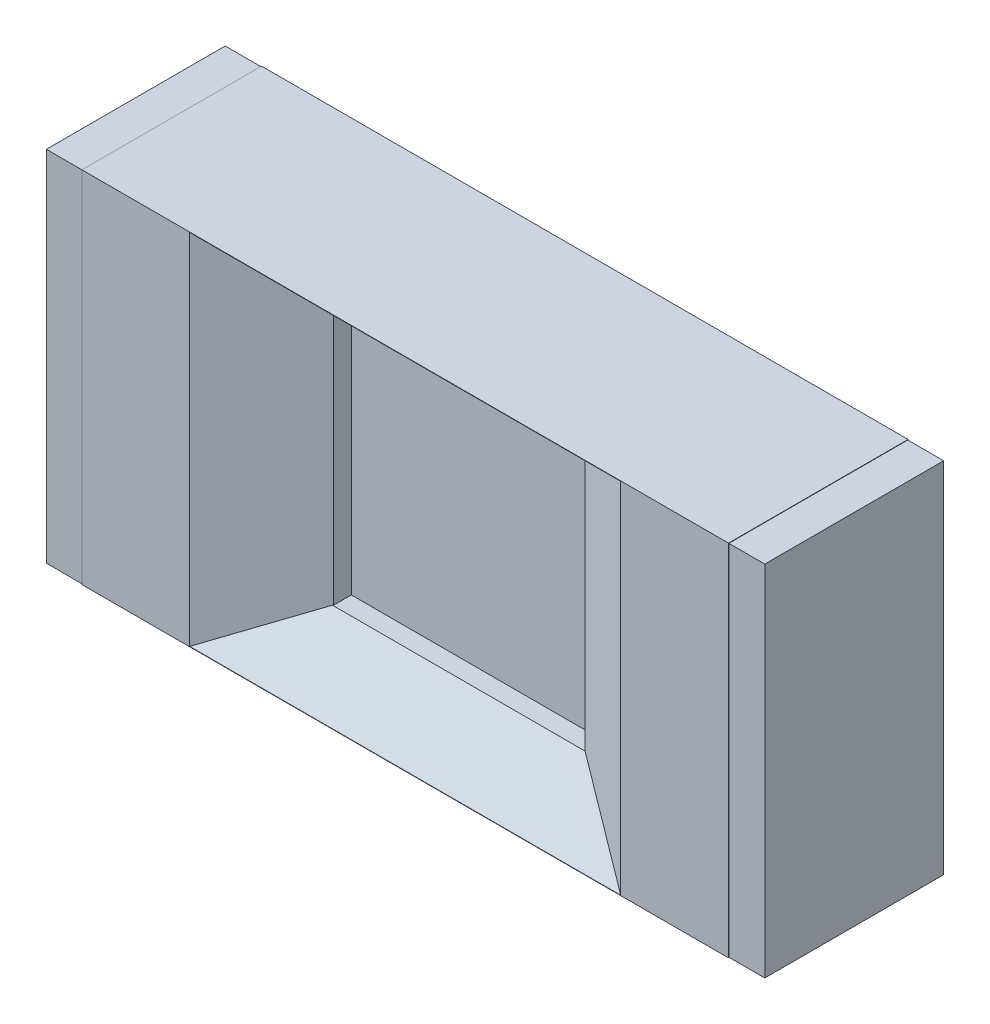
ISO-10303-21;
HEADER;
FILE_DESCRIPTION(('STEP AP214'),'2;1');
FILE_NAME('part.step','',(''),(''),'','','');
FILE_SCHEMA(('AUTOMOTIVE_DESIGN { 1 0 10303 214 1 1 1 1 }'));
ENDSEC;
DATA;
#1=APPLICATION_CONTEXT('core data for automotive mechanical design processes');
#2=APPLICATION_PROTOCOL_DEFINITION('international standard','automotive_design',2000,#1);
#3=PRODUCT_CONTEXT('',#1,'mechanical');
#4=PRODUCT('Part','Part','',(#3));
#5=PRODUCT_RELATED_PRODUCT_CATEGORY('part','',(#4));
#6=PRODUCT_DEFINITION_FORMATION('','',#4);
#7=PRODUCT_DEFINITION_CONTEXT('part definition',#1,'design');
#8=PRODUCT_DEFINITION('design','',#6,#7);
#9=PRODUCT_DEFINITION_SHAPE('','',#8);
#10=(LENGTH_UNIT() NAMED_UNIT(*) SI_UNIT(.MILLI.,.METRE.));
#11=(NAMED_UNIT(*) PLANE_ANGLE_UNIT() SI_UNIT($,.RADIAN.));
#12=(NAMED_UNIT(*) SI_UNIT($,.STERADIAN.) SOLID_ANGLE_UNIT());
#13=UNCERTAINTY_MEASURE_WITH_UNIT(LENGTH_MEASURE(1.E-05),#10,'distance_accuracy_value','');
#14=(GEOMETRIC_REPRESENTATION_CONTEXT(3) GLOBAL_UNCERTAINTY_ASSIGNED_CONTEXT((#13)) GLOBAL_UNIT_ASSIGNED_CONTEXT((#10,
#11,#12)) REPRESENTATION_CONTEXT('',''));
#15=CARTESIAN_POINT('',(0.,0.,0.));
#16=DIRECTION('',(0.,0.,1.));
#17=DIRECTION('',(1.,0.,0.));
#18=AXIS2_PLACEMENT_3D('',#15,#16,#17);
#19=CARTESIAN_POINT('',(28.13,-12.,3.201));
#20=DIRECTION('',(0.,0.,-1.));
#21=DIRECTION('',(0.,-1.,0.));
#22=AXIS2_PLACEMENT_3D('',#19,#20,#21);
#23=PLANE('',#22);
#24=DIRECTION('',(1.,0.,0.));
#25=VECTOR('',#24,1.);
#26=CARTESIAN_POINT('',(28.13,-11.999,3.201));
#27=LINE('',#26,#25);
#28=CARTESIAN_POINT('',(28.03,-11.999,3.201));
#29=VERTEX_POINT('',#28);
#30=CARTESIAN_POINT('',(28.13,-11.999,3.201));
#31=VERTEX_POINT('',#30);
#32=EDGE_CURVE('E207',#29,#31,#27,.T.);
#33=ORIENTED_EDGE('',*,*,#32,.F.);
#34=DIRECTION('',(0.,-1.,0.));
#35=VECTOR('',#34,1.);
#36=CARTESIAN_POINT('',(28.03,-12.,3.201));
#37=LINE('',#36,#35);
#38=CARTESIAN_POINT('',(28.03,-11.001,3.201));
#39=VERTEX_POINT('',#38);
#40=EDGE_CURVE('E11',#39,#29,#37,.T.);
#41=ORIENTED_EDGE('',*,*,#40,.F.);
#42=DIRECTION('',(1.,0.,0.));
#43=VECTOR('',#42,1.);
#44=CARTESIAN_POINT('',(28.13,-11.001,3.201));
#45=LINE('',#44,#43);
#46=CARTESIAN_POINT('',(28.13,-11.001,3.201));
#47=VERTEX_POINT('',#46);
#48=EDGE_CURVE('E205',#39,#47,#45,.T.);
#49=ORIENTED_EDGE('',*,*,#48,.T.);
#50=DIRECTION('',(0.,-1.,0.));
#51=VECTOR('',#50,1.);
#52=CARTESIAN_POINT('',(28.13,-12.,3.201));
#53=LINE('',#52,#51);
#54=EDGE_CURVE('E170',#47,#31,#53,.T.);
#55=ORIENTED_EDGE('',*,*,#54,.T.);
#56=EDGE_LOOP('',(#33,#41,#49,#55));
#57=FACE_BOUND('',#56,.T.);
#58=ADVANCED_FACE('F18',(#57),#23,.T.);
#59=CARTESIAN_POINT('',(28.03,-12.,3.2));
#60=DIRECTION('',(-1.,0.,0.));
#61=DIRECTION('',(0.,0.,1.));
#62=AXIS2_PLACEMENT_3D('',#59,#60,#61);
#63=PLANE('',#62);
#64=ORIENTED_EDGE('',*,*,#40,.T.);
#65=DIRECTION('',(0.,0.,1.));
#66=VECTOR('',#65,1.);
#67=CARTESIAN_POINT('',(28.03,-11.999,3.2));
#68=LINE('',#67,#66);
#69=CARTESIAN_POINT('',(28.03,-11.999,3.699));
#70=VERTEX_POINT('',#69);
#71=EDGE_CURVE('E264',#29,#70,#68,.T.);
#72=ORIENTED_EDGE('',*,*,#71,.T.);
#73=DIRECTION('',(0.,1.,0.));
#74=VECTOR('',#73,1.);
#75=CARTESIAN_POINT('',(28.03,-12.,3.699));
#76=LINE('',#75,#74);
#77=CARTESIAN_POINT('',(28.03,-11.001,3.699));
#78=VERTEX_POINT('',#77);
#79=EDGE_CURVE('E265',#70,#78,#76,.T.);
#80=ORIENTED_EDGE('',*,*,#79,.T.);
#81=DIRECTION('',(0.,0.,-1.));
#82=VECTOR('',#81,1.);
#83=CARTESIAN_POINT('',(28.03,-11.001,3.2));
#84=LINE('',#83,#82);
#85=EDGE_CURVE('E29',#78,#39,#84,.T.);
#86=ORIENTED_EDGE('',*,*,#85,.T.);
#87=EDGE_LOOP('',(#64,#72,#80,#86));
#88=FACE_BOUND('',#87,.T.);
#89=ADVANCED_FACE('F490',(#88),#63,.T.);
#90=CARTESIAN_POINT('',(28.13,-11.001,3.2));
#91=DIRECTION('',(0.,1.,0.));
#92=DIRECTION('',(1.,0.,0.));
#93=AXIS2_PLACEMENT_3D('',#90,#91,#92);
#94=PLANE('',#93);
#95=ORIENTED_EDGE('',*,*,#48,.F.);
#96=ORIENTED_EDGE('',*,*,#85,.F.);
#97=DIRECTION('',(1.,0.,0.));
#98=VECTOR('',#97,1.);
#99=CARTESIAN_POINT('',(28.13,-11.001,3.699));
#100=LINE('',#99,#98);
#101=CARTESIAN_POINT('',(28.13,-11.001,3.699));
#102=VERTEX_POINT('',#101);
#103=EDGE_CURVE('E249',#78,#102,#100,.T.);
#104=ORIENTED_EDGE('',*,*,#103,.T.);
#105=DIRECTION('',(0.,0.,-1.));
#106=VECTOR('',#105,1.);
#107=CARTESIAN_POINT('',(28.13,-11.001,3.2));
#108=LINE('',#107,#106);
#109=EDGE_CURVE('E174',#102,#47,#108,.T.);
#110=ORIENTED_EDGE('',*,*,#109,.T.);
#111=EDGE_LOOP('',(#95,#96,#104,#110));
#112=FACE_BOUND('',#111,.T.);
#113=ADVANCED_FACE('F20',(#112),#94,.T.);
#114=CARTESIAN_POINT('',(28.13,-11.999,3.2));
#115=DIRECTION('',(0.,-1.,0.));
#116=DIRECTION('',(-1.,0.,0.));
#117=AXIS2_PLACEMENT_3D('',#114,#115,#116);
#118=PLANE('',#117);
#119=DIRECTION('',(1.,0.,0.));
#120=VECTOR('',#119,1.);
#121=CARTESIAN_POINT('',(28.13,-11.999,3.699));
#122=LINE('',#121,#120);
#123=CARTESIAN_POINT('',(28.13,-11.999,3.699));
#124=VERTEX_POINT('',#123);
#125=EDGE_CURVE('E261',#70,#124,#122,.T.);
#126=ORIENTED_EDGE('',*,*,#125,.F.);
#127=ORIENTED_EDGE('',*,*,#71,.F.);
#128=ORIENTED_EDGE('',*,*,#32,.T.);
#129=DIRECTION('',(0.,0.,1.));
#130=VECTOR('',#129,1.);
#131=CARTESIAN_POINT('',(28.13,-11.999,3.2));
#132=LINE('',#131,#130);
#133=EDGE_CURVE('E175',#31,#124,#132,.T.);
#134=ORIENTED_EDGE('',*,*,#133,.T.);
#135=EDGE_LOOP('',(#126,#127,#128,#134));
#136=FACE_BOUND('',#135,.T.);
#137=ADVANCED_FACE('F503',(#136),#118,.T.);
#138=CARTESIAN_POINT('',(28.13,-12.,3.699));
#139=DIRECTION('',(0.,0.,1.));
#140=DIRECTION('',(1.,0.,0.));
#141=AXIS2_PLACEMENT_3D('',#138,#139,#140);
#142=PLANE('',#141);
#143=ORIENTED_EDGE('',*,*,#103,.F.);
#144=ORIENTED_EDGE('',*,*,#79,.F.);
#145=ORIENTED_EDGE('',*,*,#125,.T.);
#146=DIRECTION('',(0.,1.,0.));
#147=VECTOR('',#146,1.);
#148=CARTESIAN_POINT('',(28.13,-12.,3.699));
#149=LINE('',#148,#147);
#150=EDGE_CURVE('E232',#124,#102,#149,.T.);
#151=ORIENTED_EDGE('',*,*,#150,.T.);
#152=EDGE_LOOP('',(#143,#144,#145,#151));
#153=FACE_BOUND('',#152,.T.);
#154=ADVANCED_FACE('F506',(#153),#142,.T.);
#155=CARTESIAN_POINT('',(28.13,-11.5,3.45));
#156=DIRECTION('',(-1.,0.,0.));
#157=DIRECTION('',(0.,0.,1.));
#158=AXIS2_PLACEMENT_3D('',#155,#156,#157);
#159=PLANE('',#158);
#160=ORIENTED_EDGE('',*,*,#150,.F.);
#161=ORIENTED_EDGE('',*,*,#133,.F.);
#162=ORIENTED_EDGE('',*,*,#54,.F.);
#163=ORIENTED_EDGE('',*,*,#109,.F.);
#164=EDGE_LOOP('',(#160,#161,#162,#163));
#165=FACE_BOUND('',#164,.T.);
#166=DIRECTION('',(0.,1.,0.));
#167=VECTOR('',#166,1.);
#168=CARTESIAN_POINT('',(28.13,-12.,3.7));
#169=LINE('',#168,#167);
#170=CARTESIAN_POINT('',(28.13,-12.,3.7));
#171=VERTEX_POINT('',#170);
#172=CARTESIAN_POINT('',(28.13,-11.,3.7));
#173=VERTEX_POINT('',#172);
#174=EDGE_CURVE('E254',#171,#173,#169,.T.);
#175=ORIENTED_EDGE('',*,*,#174,.T.);
#176=DIRECTION('',(0.,0.,-1.));
#177=VECTOR('',#176,1.);
#178=CARTESIAN_POINT('',(28.13,-11.,3.2));
#179=LINE('',#178,#177);
#180=CARTESIAN_POINT('',(28.13,-11.,3.2));
#181=VERTEX_POINT('',#180);
#182=EDGE_CURVE('E227',#173,#181,#179,.T.);
#183=ORIENTED_EDGE('',*,*,#182,.T.);
#184=DIRECTION('',(0.,-1.,0.));
#185=VECTOR('',#184,1.);
#186=CARTESIAN_POINT('',(28.13,-12.,3.2));
#187=LINE('',#186,#185);
#188=CARTESIAN_POINT('',(28.13,-12.,3.2));
#189=VERTEX_POINT('',#188);
#190=EDGE_CURVE('E218',#181,#189,#187,.T.);
#191=ORIENTED_EDGE('',*,*,#190,.T.);
#192=DIRECTION('',(0.,0.,1.));
#193=VECTOR('',#192,1.);
#194=CARTESIAN_POINT('',(28.13,-12.,3.2));
#195=LINE('',#194,#193);
#196=EDGE_CURVE('E228',#189,#171,#195,.T.);
#197=ORIENTED_EDGE('',*,*,#196,.T.);
#198=EDGE_LOOP('',(#175,#183,#191,#197));
#199=FACE_BOUND('',#198,.T.);
#200=ADVANCED_FACE('F388',(#165,#199),#159,.T.);
#201=CARTESIAN_POINT('',(29.93,-12.,3.201));
#202=DIRECTION('',(0.,0.,-1.));
#203=DIRECTION('',(-1.,0.,0.));
#204=AXIS2_PLACEMENT_3D('',#201,#202,#203);
#205=PLANE('',#204);
#206=DIRECTION('',(0.,-1.,0.));
#207=VECTOR('',#206,1.);
#208=CARTESIAN_POINT('',(29.93,-12.,3.201));
#209=LINE('',#208,#207);
#210=CARTESIAN_POINT('',(29.93,-11.001,3.201));
#211=VERTEX_POINT('',#210);
#212=CARTESIAN_POINT('',(29.93,-11.999,3.201));
#213=VERTEX_POINT('',#212);
#214=EDGE_CURVE('E191',#211,#213,#209,.T.);
#215=ORIENTED_EDGE('',*,*,#214,.F.);
#216=DIRECTION('',(-1.,0.,0.));
#217=VECTOR('',#216,1.);
#218=CARTESIAN_POINT('',(29.93,-11.001,3.201));
#219=LINE('',#218,#217);
#220=CARTESIAN_POINT('',(30.03,-11.001,3.201));
#221=VERTEX_POINT('',#220);
#222=EDGE_CURVE('E213',#221,#211,#219,.T.);
#223=ORIENTED_EDGE('',*,*,#222,.F.);
#224=DIRECTION('',(0.,-1.,0.));
#225=VECTOR('',#224,1.);
#226=CARTESIAN_POINT('',(30.03,-12.,3.201));
#227=LINE('',#226,#225);
#228=CARTESIAN_POINT('',(30.03,-11.999,3.201));
#229=VERTEX_POINT('',#228);
#230=EDGE_CURVE('E277',#221,#229,#227,.T.);
#231=ORIENTED_EDGE('',*,*,#230,.T.);
#232=DIRECTION('',(-1.,0.,0.));
#233=VECTOR('',#232,1.);
#234=CARTESIAN_POINT('',(29.93,-11.999,3.201));
#235=LINE('',#234,#233);
#236=EDGE_CURVE('E267',#229,#213,#235,.T.);
#237=ORIENTED_EDGE('',*,*,#236,.T.);
#238=EDGE_LOOP('',(#215,#223,#231,#237));
#239=FACE_BOUND('',#238,.T.);
#240=ADVANCED_FACE('F515',(#239),#205,.T.);
#241=CARTESIAN_POINT('',(30.03,-11.,3.2));
#242=DIRECTION('',(1.,0.,0.));
#243=DIRECTION('',(0.,1.,0.));
#244=AXIS2_PLACEMENT_3D('',#241,#242,#243);
#245=PLANE('',#244);
#246=ORIENTED_EDGE('',*,*,#230,.F.);
#247=DIRECTION('',(0.,0.,-1.));
#248=VECTOR('',#247,1.);
#249=CARTESIAN_POINT('',(30.03,-11.001,3.2));
#250=LINE('',#249,#248);
#251=CARTESIAN_POINT('',(30.03,-11.001,3.699));
#252=VERTEX_POINT('',#251);
#253=EDGE_CURVE('E209',#252,#221,#250,.T.);
#254=ORIENTED_EDGE('',*,*,#253,.F.);
#255=DIRECTION('',(0.,1.,0.));
#256=VECTOR('',#255,1.);
#257=CARTESIAN_POINT('',(30.03,-12.,3.699));
#258=LINE('',#257,#256);
#259=CARTESIAN_POINT('',(30.03,-11.999,3.699));
#260=VERTEX_POINT('',#259);
#261=EDGE_CURVE('E182',#260,#252,#258,.T.);
#262=ORIENTED_EDGE('',*,*,#261,.F.);
#263=DIRECTION('',(0.,0.,1.));
#264=VECTOR('',#263,1.);
#265=CARTESIAN_POINT('',(30.03,-11.999,3.2));
#266=LINE('',#265,#264);
#267=EDGE_CURVE('E214',#229,#260,#266,.T.);
#268=ORIENTED_EDGE('',*,*,#267,.F.);
#269=EDGE_LOOP('',(#246,#254,#262,#268));
#270=FACE_BOUND('',#269,.T.);
#271=ADVANCED_FACE('F697',(#270),#245,.T.);
#272=CARTESIAN_POINT('',(29.93,-11.001,3.2));
#273=DIRECTION('',(0.,1.,0.));
#274=DIRECTION('',(1.,0.,0.));
#275=AXIS2_PLACEMENT_3D('',#272,#273,#274);
#276=PLANE('',#275);
#277=DIRECTION('',(0.,0.,-1.));
#278=VECTOR('',#277,1.);
#279=CARTESIAN_POINT('',(29.93,-11.001,3.2));
#280=LINE('',#279,#278);
#281=CARTESIAN_POINT('',(29.93,-11.001,3.699));
#282=VERTEX_POINT('',#281);
#283=EDGE_CURVE('E187',#282,#211,#280,.T.);
#284=ORIENTED_EDGE('',*,*,#283,.F.);
#285=DIRECTION('',(-1.,0.,0.));
#286=VECTOR('',#285,1.);
#287=CARTESIAN_POINT('',(29.93,-11.001,3.699));
#288=LINE('',#287,#286);
#289=EDGE_CURVE('E22',#252,#282,#288,.T.);
#290=ORIENTED_EDGE('',*,*,#289,.F.);
#291=ORIENTED_EDGE('',*,*,#253,.T.);
#292=ORIENTED_EDGE('',*,*,#222,.T.);
#293=EDGE_LOOP('',(#284,#290,#291,#292));
#294=FACE_BOUND('',#293,.T.);
#295=ADVANCED_FACE('F686',(#294),#276,.T.);
#296=CARTESIAN_POINT('',(29.93,-11.999,3.2));
#297=DIRECTION('',(0.,-1.,0.));
#298=DIRECTION('',(0.,0.,-1.));
#299=AXIS2_PLACEMENT_3D('',#296,#297,#298);
#300=PLANE('',#299);
#301=DIRECTION('',(0.,0.,1.));
#302=VECTOR('',#301,1.);
#303=CARTESIAN_POINT('',(29.93,-11.999,3.2));
#304=LINE('',#303,#302);
#305=CARTESIAN_POINT('',(29.93,-11.999,3.699));
#306=VERTEX_POINT('',#305);
#307=EDGE_CURVE('E168',#213,#306,#304,.T.);
#308=ORIENTED_EDGE('',*,*,#307,.F.);
#309=ORIENTED_EDGE('',*,*,#236,.F.);
#310=ORIENTED_EDGE('',*,*,#267,.T.);
#311=DIRECTION('',(-1.,0.,0.));
#312=VECTOR('',#311,1.);
#313=CARTESIAN_POINT('',(29.93,-11.999,3.699));
#314=LINE('',#313,#312);
#315=EDGE_CURVE('E186',#260,#306,#314,.T.);
#316=ORIENTED_EDGE('',*,*,#315,.T.);
#317=EDGE_LOOP('',(#308,#309,#310,#316));
#318=FACE_BOUND('',#317,.T.);
#319=ADVANCED_FACE('F677',(#318),#300,.T.);
#320=CARTESIAN_POINT('',(29.93,-12.,3.699));
#321=DIRECTION('',(0.,0.,1.));
#322=DIRECTION('',(1.,0.,0.));
#323=AXIS2_PLACEMENT_3D('',#320,#321,#322);
#324=PLANE('',#323);
#325=DIRECTION('',(0.,1.,0.));
#326=VECTOR('',#325,1.);
#327=CARTESIAN_POINT('',(29.93,-12.,3.699));
#328=LINE('',#327,#326);
#329=EDGE_CURVE('E192',#306,#282,#328,.T.);
#330=ORIENTED_EDGE('',*,*,#329,.F.);
#331=ORIENTED_EDGE('',*,*,#315,.F.);
#332=ORIENTED_EDGE('',*,*,#261,.T.);
#333=ORIENTED_EDGE('',*,*,#289,.T.);
#334=EDGE_LOOP('',(#330,#331,#332,#333));
#335=FACE_BOUND('',#334,.T.);
#336=ADVANCED_FACE('F498',(#335),#324,.T.);
#337=CARTESIAN_POINT('',(29.93,-11.5,3.45));
#338=DIRECTION('',(1.,0.,0.));
#339=DIRECTION('',(0.,1.,0.));
#340=AXIS2_PLACEMENT_3D('',#337,#338,#339);
#341=PLANE('',#340);
#342=ORIENTED_EDGE('',*,*,#329,.T.);
#343=ORIENTED_EDGE('',*,*,#283,.T.);
#344=ORIENTED_EDGE('',*,*,#214,.T.);
#345=ORIENTED_EDGE('',*,*,#307,.T.);
#346=EDGE_LOOP('',(#342,#343,#344,#345));
#347=FACE_BOUND('',#346,.T.);
#348=DIRECTION('',(0.,1.,0.));
#349=VECTOR('',#348,1.);
#350=CARTESIAN_POINT('',(29.93,-12.,3.7));
#351=LINE('',#350,#349);
#352=CARTESIAN_POINT('',(29.93,-12.,3.7));
#353=VERTEX_POINT('',#352);
#354=CARTESIAN_POINT('',(29.93,-11.,3.7));
#355=VERTEX_POINT('',#354);
#356=EDGE_CURVE('E255',#353,#355,#351,.T.);
#357=ORIENTED_EDGE('',*,*,#356,.F.);
#358=DIRECTION('',(0.,0.,1.));
#359=VECTOR('',#358,1.);
#360=CARTESIAN_POINT('',(29.93,-12.,3.2));
#361=LINE('',#360,#359);
#362=CARTESIAN_POINT('',(29.93,-12.,3.2));
#363=VERTEX_POINT('',#362);
#364=EDGE_CURVE('E344',#363,#353,#361,.T.);
#365=ORIENTED_EDGE('',*,*,#364,.F.);
#366=DIRECTION('',(0.,-1.,0.));
#367=VECTOR('',#366,1.);
#368=CARTESIAN_POINT('',(29.93,-12.,3.2));
#369=LINE('',#368,#367);
#370=CARTESIAN_POINT('',(29.93,-11.,3.2));
#371=VERTEX_POINT('',#370);
#372=EDGE_CURVE('E138',#371,#363,#369,.T.);
#373=ORIENTED_EDGE('',*,*,#372,.F.);
#374=DIRECTION('',(0.,0.,-1.));
#375=VECTOR('',#374,1.);
#376=CARTESIAN_POINT('',(29.93,-11.,3.2));
#377=LINE('',#376,#375);
#378=EDGE_CURVE('E242',#355,#371,#377,.T.);
#379=ORIENTED_EDGE('',*,*,#378,.F.);
#380=EDGE_LOOP('',(#357,#365,#373,#379));
#381=FACE_BOUND('',#380,.T.);
#382=ADVANCED_FACE('F453',(#347,#381),#341,.T.);
#383=CARTESIAN_POINT('',(29.03,-11.5,3.5));
#384=DIRECTION('',(0.,0.,-1.));
#385=DIRECTION('',(0.,-1.,0.));
#386=AXIS2_PLACEMENT_3D('',#383,#384,#385);
#387=PLANE('',#386);
#388=DIRECTION('',(0.,1.,0.));
#389=VECTOR('',#388,1.);
#390=CARTESIAN_POINT('',(28.68,-11.85,3.5));
#391=LINE('',#390,#389);
#392=CARTESIAN_POINT('',(28.68,-11.85,3.5));
#393=VERTEX_POINT('',#392);
#394=CARTESIAN_POINT('',(28.68,-11.15,3.5));
#395=VERTEX_POINT('',#394);
#396=EDGE_CURVE('E132',#393,#395,#391,.T.);
#397=ORIENTED_EDGE('',*,*,#396,.F.);
#398=DIRECTION('',(-1.,0.,0.));
#399=VECTOR('',#398,1.);
#400=CARTESIAN_POINT('',(29.38,-11.85,3.5));
#401=LINE('',#400,#399);
#402=CARTESIAN_POINT('',(29.38,-11.85,3.5));
#403=VERTEX_POINT('',#402);
#404=EDGE_CURVE('E197',#403,#393,#401,.T.);
#405=ORIENTED_EDGE('',*,*,#404,.F.);
#406=DIRECTION('',(0.,-1.,0.));
#407=VECTOR('',#406,1.);
#408=CARTESIAN_POINT('',(29.38,-11.15,3.5));
#409=LINE('',#408,#407);
#410=CARTESIAN_POINT('',(29.38,-11.15,3.5));
#411=VERTEX_POINT('',#410);
#412=EDGE_CURVE('E302',#411,#403,#409,.T.);
#413=ORIENTED_EDGE('',*,*,#412,.F.);
#414=DIRECTION('',(1.,0.,0.));
#415=VECTOR('',#414,1.);
#416=CARTESIAN_POINT('',(28.68,-11.15,3.5));
#417=LINE('',#416,#415);
#418=EDGE_CURVE('E137',#395,#411,#417,.T.);
#419=ORIENTED_EDGE('',*,*,#418,.F.);
#420=EDGE_LOOP('',(#397,#405,#413,#419));
#421=FACE_BOUND('',#420,.T.);
#422=ADVANCED_FACE('F520',(#421),#387,.F.);
#423=CARTESIAN_POINT('',(29.38,-11.15,3.7));
#424=DIRECTION('',(-1.,0.,0.));
#425=DIRECTION('',(0.,0.,1.));
#426=AXIS2_PLACEMENT_3D('',#423,#424,#425);
#427=PLANE('',#426);
#428=DIRECTION('',(0.,0.,-1.));
#429=VECTOR('',#428,1.);
#430=CARTESIAN_POINT('',(29.38,-11.15,3.7));
#431=LINE('',#430,#429);
#432=CARTESIAN_POINT('',(29.38,-11.15,3.55));
#433=VERTEX_POINT('',#432);
#434=EDGE_CURVE('E198',#433,#411,#431,.T.);
#435=ORIENTED_EDGE('',*,*,#434,.T.);
#436=ORIENTED_EDGE('',*,*,#412,.T.);
#437=DIRECTION('',(0.,0.,-1.));
#438=VECTOR('',#437,1.);
#439=CARTESIAN_POINT('',(29.38,-11.85,3.7));
#440=LINE('',#439,#438);
#441=CARTESIAN_POINT('',(29.38,-11.85,3.55));
#442=VERTEX_POINT('',#441);
#443=EDGE_CURVE('E193',#442,#403,#440,.T.);
#444=ORIENTED_EDGE('',*,*,#443,.F.);
#445=DIRECTION('',(0.,-1.,0.));
#446=VECTOR('',#445,1.);
#447=CARTESIAN_POINT('',(29.38,-11.15,3.55));
#448=LINE('',#447,#446);
#449=EDGE_CURVE('E204',#433,#442,#448,.T.);
#450=ORIENTED_EDGE('',*,*,#449,.F.);
#451=EDGE_LOOP('',(#435,#436,#444,#450));
#452=FACE_BOUND('',#451,.T.);
#453=ADVANCED_FACE('F502',(#452),#427,.T.);
#454=CARTESIAN_POINT('',(28.68,-11.85,3.7));
#455=DIRECTION('',(1.,0.,0.));
#456=DIRECTION('',(0.,1.,0.));
#457=AXIS2_PLACEMENT_3D('',#454,#455,#456);
#458=PLANE('',#457);
#459=DIRECTION('',(0.,0.,-1.));
#460=VECTOR('',#459,1.);
#461=CARTESIAN_POINT('',(28.68,-11.85,3.7));
#462=LINE('',#461,#460);
#463=CARTESIAN_POINT('',(28.68,-11.85,3.55));
#464=VERTEX_POINT('',#463);
#465=EDGE_CURVE('E258',#464,#393,#462,.T.);
#466=ORIENTED_EDGE('',*,*,#465,.T.);
#467=ORIENTED_EDGE('',*,*,#396,.T.);
#468=DIRECTION('',(0.,0.,-1.));
#469=VECTOR('',#468,1.);
#470=CARTESIAN_POINT('',(28.68,-11.15,3.7));
#471=LINE('',#470,#469);
#472=CARTESIAN_POINT('',(28.68,-11.15,3.55));
#473=VERTEX_POINT('',#472);
#474=EDGE_CURVE('E125',#473,#395,#471,.T.);
#475=ORIENTED_EDGE('',*,*,#474,.F.);
#476=DIRECTION('',(0.,1.,0.));
#477=VECTOR('',#476,1.);
#478=CARTESIAN_POINT('',(28.68,-11.85,3.55));
#479=LINE('',#478,#477);
#480=EDGE_CURVE('E130',#464,#473,#479,.T.);
#481=ORIENTED_EDGE('',*,*,#480,.F.);
#482=EDGE_LOOP('',(#466,#467,#475,#481));
#483=FACE_BOUND('',#482,.T.);
#484=ADVANCED_FACE('F128',(#483),#458,.T.);
#485=CARTESIAN_POINT('',(29.38,-11.85,3.7));
#486=DIRECTION('',(0.,1.,0.));
#487=DIRECTION('',(1.,0.,0.));
#488=AXIS2_PLACEMENT_3D('',#485,#486,#487);
#489=PLANE('',#488);
#490=DIRECTION('',(-0.857492925712456,0.,-0.514495755427674));
#491=VECTOR('',#490,1.);
#492=CARTESIAN_POINT('',(29.475588235294,-11.85,3.607352941176));
#493=LINE('',#492,#491);
#494=CARTESIAN_POINT('',(29.381666666666,-11.85,3.551));
#495=VERTEX_POINT('',#494);
#496=EDGE_CURVE('E199',#495,#442,#493,.T.);
#497=ORIENTED_EDGE('',*,*,#496,.T.);
#498=ORIENTED_EDGE('',*,*,#443,.T.);
#499=ORIENTED_EDGE('',*,*,#404,.T.);
#500=ORIENTED_EDGE('',*,*,#465,.F.);
#501=DIRECTION('',(0.857492925712456,0.,-0.514495755427674));
#502=VECTOR('',#501,1.);
#503=CARTESIAN_POINT('',(28.841764705882,-11.85,3.452941176471));
#504=LINE('',#503,#502);
#505=CARTESIAN_POINT('',(28.678333333333,-11.85,3.551));
#506=VERTEX_POINT('',#505);
#507=EDGE_CURVE('E156',#506,#464,#504,.T.);
#508=ORIENTED_EDGE('',*,*,#507,.F.);
#509=DIRECTION('',(-1.,0.,0.));
#510=VECTOR('',#509,1.);
#511=CARTESIAN_POINT('',(28.68,-11.85,3.551));
#512=LINE('',#511,#510);
#513=EDGE_CURVE('E335',#495,#506,#512,.T.);
#514=ORIENTED_EDGE('',*,*,#513,.F.);
#515=EDGE_LOOP('',(#497,#498,#499,#500,#508,#514));
#516=FACE_BOUND('',#515,.T.);
#517=ADVANCED_FACE('F471',(#516),#489,.T.);
#518=CARTESIAN_POINT('',(28.68,-11.15,3.7));
#519=DIRECTION('',(0.,-1.,0.));
#520=DIRECTION('',(0.,0.,-1.));
#521=AXIS2_PLACEMENT_3D('',#518,#519,#520);
#522=PLANE('',#521);
#523=DIRECTION('',(0.857492925712456,0.,-0.514495755427674));
#524=VECTOR('',#523,1.);
#525=CARTESIAN_POINT('',(28.584411764705,-11.15,3.607352941176));
#526=LINE('',#525,#524);
#527=CARTESIAN_POINT('',(28.678333333333,-11.15,3.551));
#528=VERTEX_POINT('',#527);
#529=EDGE_CURVE('E142',#528,#473,#526,.T.);
#530=ORIENTED_EDGE('',*,*,#529,.T.);
#531=ORIENTED_EDGE('',*,*,#474,.T.);
#532=ORIENTED_EDGE('',*,*,#418,.T.);
#533=ORIENTED_EDGE('',*,*,#434,.F.);
#534=DIRECTION('',(-0.857492925712456,0.,-0.514495755427674));
#535=VECTOR('',#534,1.);
#536=CARTESIAN_POINT('',(29.218235294117,-11.15,3.452941176471));
#537=LINE('',#536,#535);
#538=CARTESIAN_POINT('',(29.381666666666,-11.15,3.551));
#539=VERTEX_POINT('',#538);
#540=EDGE_CURVE('E331',#539,#433,#537,.T.);
#541=ORIENTED_EDGE('',*,*,#540,.F.);
#542=DIRECTION('',(1.,0.,0.));
#543=VECTOR('',#542,1.);
#544=CARTESIAN_POINT('',(29.38,-11.15,3.551));
#545=LINE('',#544,#543);
#546=EDGE_CURVE('E145',#528,#539,#545,.T.);
#547=ORIENTED_EDGE('',*,*,#546,.F.);
#548=EDGE_LOOP('',(#530,#531,#532,#533,#541,#547));
#549=FACE_BOUND('',#548,.T.);
#550=ADVANCED_FACE('F143',(#549),#522,.T.);
#551=CARTESIAN_POINT('',(29.03,-11.5,3.2));
#552=DIRECTION('',(0.,0.,-1.));
#553=DIRECTION('',(0.,-1.,0.));
#554=AXIS2_PLACEMENT_3D('',#551,#552,#553);
#555=PLANE('',#554);
#556=DIRECTION('',(-1.,0.,0.));
#557=VECTOR('',#556,1.);
#558=CARTESIAN_POINT('',(30.03,-12.,3.2));
#559=LINE('',#558,#557);
#560=EDGE_CURVE('E347',#363,#189,#559,.T.);
#561=ORIENTED_EDGE('',*,*,#560,.T.);
#562=ORIENTED_EDGE('',*,*,#190,.F.);
#563=DIRECTION('',(1.,0.,0.));
#564=VECTOR('',#563,1.);
#565=CARTESIAN_POINT('',(28.03,-11.,3.2));
#566=LINE('',#565,#564);
#567=EDGE_CURVE('E223',#181,#371,#566,.T.);
#568=ORIENTED_EDGE('',*,*,#567,.T.);
#569=ORIENTED_EDGE('',*,*,#372,.T.);
#570=EDGE_LOOP('',(#561,#562,#568,#569));
#571=FACE_BOUND('',#570,.T.);
#572=ADVANCED_FACE('F451',(#571),#555,.T.);
#573=CARTESIAN_POINT('',(29.03,-11.93898373043,3.639983730433));
#574=DIRECTION('',(0.,0.707106781186548,0.707106781186548));
#575=DIRECTION('',(1.,0.,0.));
#576=AXIS2_PLACEMENT_3D('',#573,#574,#575);
#577=PLANE('',#576);
#578=DIRECTION('',(-1.,0.,0.));
#579=VECTOR('',#578,1.);
#580=CARTESIAN_POINT('',(29.63,-11.999,3.7));
#581=LINE('',#580,#579);
#582=CARTESIAN_POINT('',(29.63,-11.999,3.7));
#583=VERTEX_POINT('',#582);
#584=CARTESIAN_POINT('',(28.43,-11.999,3.7));
#585=VERTEX_POINT('',#584);
#586=EDGE_CURVE('E181',#583,#585,#581,.T.);
#587=ORIENTED_EDGE('',*,*,#586,.F.);
#588=DIRECTION('',(-0.762492851662884,0.45749571099793,-0.45749571099793));
#589=VECTOR('',#588,1.);
#590=CARTESIAN_POINT('',(29.406511627907,-11.86490697674,3.565906976744));
#591=LINE('',#590,#589);
#592=EDGE_CURVE('E203',#583,#495,#591,.T.);
#593=ORIENTED_EDGE('',*,*,#592,.T.);
#594=ORIENTED_EDGE('',*,*,#513,.T.);
#595=DIRECTION('',(0.762492851662884,0.45749571099793,-0.45749571099793));
#596=VECTOR('',#595,1.);
#597=CARTESIAN_POINT('',(28.604069767441,-11.89455813953,3.595558139535));
#598=LINE('',#597,#596);
#599=EDGE_CURVE('E150',#585,#506,#598,.T.);
#600=ORIENTED_EDGE('',*,*,#599,.F.);
#601=EDGE_LOOP('',(#587,#593,#594,#600));
#602=FACE_BOUND('',#601,.T.);
#603=ADVANCED_FACE('F465',(#602),#577,.T.);
#604=CARTESIAN_POINT('',(29.505,-11.15,3.625));
#605=DIRECTION('',(0.514495755427674,0.,-0.857492925712456));
#606=DIRECTION('',(0.,-1.,0.));
#607=AXIS2_PLACEMENT_3D('',#604,#605,#606);
#608=PLANE('',#607);
#609=ORIENTED_EDGE('',*,*,#449,.T.);
#610=ORIENTED_EDGE('',*,*,#496,.F.);
#611=ORIENTED_EDGE('',*,*,#592,.F.);
#612=DIRECTION('',(0.,1.,0.));
#613=VECTOR('',#612,1.);
#614=CARTESIAN_POINT('',(29.63,-11.325,3.7));
#615=LINE('',#614,#613);
#616=CARTESIAN_POINT('',(29.63,-11.001,3.7));
#617=VERTEX_POINT('',#616);
#618=EDGE_CURVE('E222',#583,#617,#615,.T.);
#619=ORIENTED_EDGE('',*,*,#618,.T.);
#620=DIRECTION('',(-0.762492851662884,-0.45749571099793,-0.45749571099793));
#621=VECTOR('',#620,1.);
#622=CARTESIAN_POINT('',(29.455930232558,-11.10544186046,3.595558139535));
#623=LINE('',#622,#621);
#624=EDGE_CURVE('E158',#617,#539,#623,.T.);
#625=ORIENTED_EDGE('',*,*,#624,.T.);
#626=ORIENTED_EDGE('',*,*,#540,.T.);
#627=EDGE_LOOP('',(#609,#610,#611,#619,#625,#626));
#628=FACE_BOUND('',#627,.T.);
#629=ADVANCED_FACE('F468',(#628),#608,.F.);
#630=CARTESIAN_POINT('',(28.555,-11.85,3.625));
#631=DIRECTION('',(-0.514495755427674,0.,-0.857492925712456));
#632=DIRECTION('',(-0.857492925712456,0.,0.514495755427674));
#633=AXIS2_PLACEMENT_3D('',#630,#631,#632);
#634=PLANE('',#633);
#635=ORIENTED_EDGE('',*,*,#480,.T.);
#636=ORIENTED_EDGE('',*,*,#529,.F.);
#637=DIRECTION('',(0.762492851662884,-0.45749571099793,-0.45749571099793));
#638=VECTOR('',#637,1.);
#639=CARTESIAN_POINT('',(28.653488372093,-11.13509302325,3.565906976744));
#640=LINE('',#639,#638);
#641=CARTESIAN_POINT('',(28.43,-11.001,3.7));
#642=VERTEX_POINT('',#641);
#643=EDGE_CURVE('E239',#642,#528,#640,.T.);
#644=ORIENTED_EDGE('',*,*,#643,.F.);
#645=DIRECTION('',(0.,-1.,0.));
#646=VECTOR('',#645,1.);
#647=CARTESIAN_POINT('',(28.43,-11.675,3.7));
#648=LINE('',#647,#646);
#649=EDGE_CURVE('E176',#642,#585,#648,.T.);
#650=ORIENTED_EDGE('',*,*,#649,.T.);
#651=ORIENTED_EDGE('',*,*,#599,.T.);
#652=ORIENTED_EDGE('',*,*,#507,.T.);
#653=EDGE_LOOP('',(#635,#636,#644,#650,#651,#652));
#654=FACE_BOUND('',#653,.T.);
#655=ADVANCED_FACE('F153',(#654),#634,.F.);
#656=CARTESIAN_POINT('',(29.03,-11.06101626956,3.639983730433));
#657=DIRECTION('',(0.,-0.707106781186548,0.707106781186548));
#658=DIRECTION('',(-1.,0.,0.));
#659=AXIS2_PLACEMENT_3D('',#656,#657,#658);
#660=PLANE('',#659);
#661=ORIENTED_EDGE('',*,*,#643,.T.);
#662=ORIENTED_EDGE('',*,*,#546,.T.);
#663=ORIENTED_EDGE('',*,*,#624,.F.);
#664=DIRECTION('',(1.,0.,0.));
#665=VECTOR('',#664,1.);
#666=CARTESIAN_POINT('',(28.43,-11.001,3.7));
#667=LINE('',#666,#665);
#668=EDGE_CURVE('E180',#642,#617,#667,.T.);
#669=ORIENTED_EDGE('',*,*,#668,.F.);
#670=EDGE_LOOP('',(#661,#662,#663,#669));
#671=FACE_BOUND('',#670,.T.);
#672=ADVANCED_FACE('F477',(#671),#660,.T.);
#673=CARTESIAN_POINT('',(28.03,-11.,3.2));
#674=DIRECTION('',(0.,1.,0.));
#675=DIRECTION('',(1.,0.,0.));
#676=AXIS2_PLACEMENT_3D('',#673,#674,#675);
#677=PLANE('',#676);
#678=ORIENTED_EDGE('',*,*,#567,.F.);
#679=ORIENTED_EDGE('',*,*,#182,.F.);
#680=DIRECTION('',(1.,0.,0.));
#681=VECTOR('',#680,1.);
#682=CARTESIAN_POINT('',(28.03,-11.,3.7));
#683=LINE('',#682,#681);
#684=EDGE_CURVE('E250',#173,#355,#683,.T.);
#685=ORIENTED_EDGE('',*,*,#684,.T.);
#686=ORIENTED_EDGE('',*,*,#378,.T.);
#687=EDGE_LOOP('',(#678,#679,#685,#686));
#688=FACE_BOUND('',#687,.T.);
#689=ADVANCED_FACE('F479',(#688),#677,.T.);
#690=CARTESIAN_POINT('',(30.03,-12.,3.2));
#691=DIRECTION('',(0.,-1.,0.));
#692=DIRECTION('',(0.,0.,-1.));
#693=AXIS2_PLACEMENT_3D('',#690,#691,#692);
#694=PLANE('',#693);
#695=ORIENTED_EDGE('',*,*,#560,.F.);
#696=ORIENTED_EDGE('',*,*,#364,.T.);
#697=DIRECTION('',(-1.,0.,0.));
#698=VECTOR('',#697,1.);
#699=CARTESIAN_POINT('',(30.03,-12.,3.7));
#700=LINE('',#699,#698);
#701=EDGE_CURVE('E238',#353,#171,#700,.T.);
#702=ORIENTED_EDGE('',*,*,#701,.T.);
#703=ORIENTED_EDGE('',*,*,#196,.F.);
#704=EDGE_LOOP('',(#695,#696,#702,#703));
#705=FACE_BOUND('',#704,.T.);
#706=ADVANCED_FACE('F377',(#705),#694,.T.);
#707=CARTESIAN_POINT('',(29.03,-11.5,3.7));
#708=DIRECTION('',(0.,0.,-1.));
#709=DIRECTION('',(0.,-1.,0.));
#710=AXIS2_PLACEMENT_3D('',#707,#708,#709);
#711=PLANE('',#710);
#712=ORIENTED_EDGE('',*,*,#618,.F.);
#713=ORIENTED_EDGE('',*,*,#586,.T.);
#714=ORIENTED_EDGE('',*,*,#649,.F.);
#715=ORIENTED_EDGE('',*,*,#668,.T.);
#716=EDGE_LOOP('',(#712,#713,#714,#715));
#717=FACE_BOUND('',#716,.T.);
#718=ORIENTED_EDGE('',*,*,#356,.T.);
#719=ORIENTED_EDGE('',*,*,#684,.F.);
#720=ORIENTED_EDGE('',*,*,#174,.F.);
#721=ORIENTED_EDGE('',*,*,#701,.F.);
#722=EDGE_LOOP('',(#718,#719,#720,#721));
#723=FACE_BOUND('',#722,.T.);
#724=ADVANCED_FACE('F386',(#717,#723),#711,.F.);
#725=CLOSED_SHELL('',(#58,#89,#113,#137,#154,#200,#240,#271,#295,#319,#336,#382,#422,#453,#484,
#517,#550,#572,#603,#629,#655,#672,#689,#706,#724));
#726=MANIFOLD_SOLID_BREP('B1',#725);
#727=ADVANCED_BREP_SHAPE_REPRESENTATION('',(#18,#726),#14);
#728=SHAPE_DEFINITION_REPRESENTATION(#9,#727);
ENDSEC;
END-ISO-10303-21;
